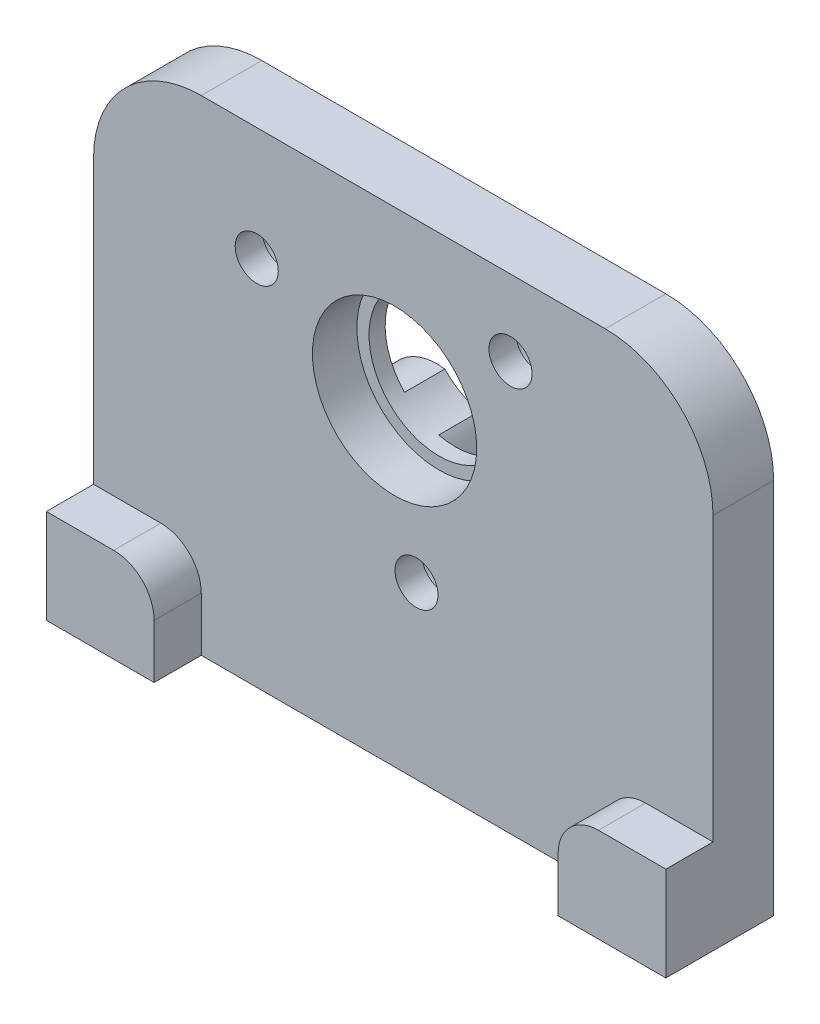
ISO-10303-21;
HEADER;
FILE_DESCRIPTION(('STEP AP214'),'2;1');
FILE_NAME('part.step','',(''),(''),'','','');
FILE_SCHEMA(('AUTOMOTIVE_DESIGN { 1 0 10303 214 1 1 1 1 }'));
ENDSEC;
DATA;
#1=APPLICATION_CONTEXT('core data for automotive mechanical design processes');
#2=APPLICATION_PROTOCOL_DEFINITION('international standard','automotive_design',2000,#1);
#3=PRODUCT_CONTEXT('',#1,'mechanical');
#4=PRODUCT('Part','Part','',(#3));
#5=PRODUCT_RELATED_PRODUCT_CATEGORY('part','',(#4));
#6=PRODUCT_DEFINITION_FORMATION('','',#4);
#7=PRODUCT_DEFINITION_CONTEXT('part definition',#1,'design');
#8=PRODUCT_DEFINITION('design','',#6,#7);
#9=PRODUCT_DEFINITION_SHAPE('','',#8);
#10=(LENGTH_UNIT() NAMED_UNIT(*) SI_UNIT(.MILLI.,.METRE.));
#11=(NAMED_UNIT(*) PLANE_ANGLE_UNIT() SI_UNIT($,.RADIAN.));
#12=(NAMED_UNIT(*) SI_UNIT($,.STERADIAN.) SOLID_ANGLE_UNIT());
#13=UNCERTAINTY_MEASURE_WITH_UNIT(LENGTH_MEASURE(1.E-05),#10,'distance_accuracy_value','');
#14=(GEOMETRIC_REPRESENTATION_CONTEXT(3) GLOBAL_UNCERTAINTY_ASSIGNED_CONTEXT((#13)) GLOBAL_UNIT_ASSIGNED_CONTEXT((#10,
#11,#12)) REPRESENTATION_CONTEXT('',''));
#15=CARTESIAN_POINT('',(0.,0.,0.));
#16=DIRECTION('',(0.,0.,1.));
#17=DIRECTION('',(1.,0.,0.));
#18=AXIS2_PLACEMENT_3D('',#15,#16,#17);
#19=CARTESIAN_POINT('',(0.,0.,4.5));
#20=DIRECTION('',(0.,0.,1.));
#21=DIRECTION('',(1.,0.,0.));
#22=AXIS2_PLACEMENT_3D('',#19,#20,#21);
#23=PLANE('',#22);
#24=CARTESIAN_POINT('',(-0.645780782,5.541728913,4.5));
#25=DIRECTION('',(0.,0.,1.));
#26=DIRECTION('',(1.,0.,0.));
#27=AXIS2_PLACEMENT_3D('',#24,#25,#26);
#28=CIRCLE('',#27,6.10000000000001);
#29=CARTESIAN_POINT('',(5.45421921800001,5.541728913,4.5));
#30=VERTEX_POINT('',#29);
#31=EDGE_CURVE('E490',#30,#30,#28,.T.);
#32=ORIENTED_EDGE('',*,*,#31,.F.);
#33=EDGE_LOOP('',(#32));
#34=FACE_BOUND('',#33,.T.);
#35=CARTESIAN_POINT('',(7.962908944,12.389389916,4.5));
#36=DIRECTION('',(0.,0.,1.));
#37=DIRECTION('',(1.,0.,0.));
#38=AXIS2_PLACEMENT_3D('',#35,#36,#37);
#39=CIRCLE('',#38,1.60000000000001);
#40=CARTESIAN_POINT('',(9.56290894400001,12.389389916,4.5));
#41=VERTEX_POINT('',#40);
#42=EDGE_CURVE('E379',#41,#41,#39,.T.);
#43=ORIENTED_EDGE('',*,*,#42,.F.);
#44=EDGE_LOOP('',(#43));
#45=FACE_BOUND('',#44,.T.);
#46=CARTESIAN_POINT('',(-10.88037403,9.573242407,4.5));
#47=DIRECTION('',(0.,0.,1.));
#48=DIRECTION('',(1.,0.,0.));
#49=AXIS2_PLACEMENT_3D('',#46,#47,#48);
#50=CIRCLE('',#49,1.60000000000001);
#51=CARTESIAN_POINT('',(-9.28037402999999,9.573242407,4.5));
#52=VERTEX_POINT('',#51);
#53=EDGE_CURVE('E374',#52,#52,#50,.T.);
#54=ORIENTED_EDGE('',*,*,#53,.F.);
#55=EDGE_LOOP('',(#54));
#56=FACE_BOUND('',#55,.T.);
#57=CARTESIAN_POINT('',(0.980122741,-5.337445584,4.5));
#58=DIRECTION('',(0.,0.,1.));
#59=DIRECTION('',(1.,0.,0.));
#60=AXIS2_PLACEMENT_3D('',#57,#58,#59);
#61=CIRCLE('',#60,1.60000000000001);
#62=CARTESIAN_POINT('',(2.58012274100001,-5.337445584,4.5));
#63=VERTEX_POINT('',#62);
#64=EDGE_CURVE('E369',#63,#63,#61,.T.);
#65=ORIENTED_EDGE('',*,*,#64,.F.);
#66=EDGE_LOOP('',(#65));
#67=FACE_BOUND('',#66,.T.);
#68=DIRECTION('',(0.,1.,0.));
#69=VECTOR('',#68,1.);
#70=CARTESIAN_POINT('',(23.,-18.,4.5));
#71=LINE('',#70,#69);
#72=CARTESIAN_POINT('',(23.,-11.,4.5));
#73=VERTEX_POINT('',#72);
#74=CARTESIAN_POINT('',(23.,10.,4.5));
#75=VERTEX_POINT('',#74);
#76=EDGE_CURVE('E263',#73,#75,#71,.T.);
#77=ORIENTED_EDGE('',*,*,#76,.T.);
#78=CARTESIAN_POINT('',(15.,10.,4.5));
#79=DIRECTION('',(0.,0.,1.));
#80=DIRECTION('',(1.,0.,0.));
#81=AXIS2_PLACEMENT_3D('',#78,#79,#80);
#82=CIRCLE('',#81,8.);
#83=CARTESIAN_POINT('',(15.,18.,4.5));
#84=VERTEX_POINT('',#83);
#85=EDGE_CURVE('E274',#75,#84,#82,.T.);
#86=ORIENTED_EDGE('',*,*,#85,.T.);
#87=DIRECTION('',(-1.,0.,0.));
#88=VECTOR('',#87,1.);
#89=CARTESIAN_POINT('',(23.,18.,4.5));
#90=LINE('',#89,#88);
#91=CARTESIAN_POINT('',(-15.,18.,4.5));
#92=VERTEX_POINT('',#91);
#93=EDGE_CURVE('E248',#84,#92,#90,.T.);
#94=ORIENTED_EDGE('',*,*,#93,.T.);
#95=CARTESIAN_POINT('',(-15.,10.,4.5));
#96=DIRECTION('',(0.,0.,1.));
#97=DIRECTION('',(1.,0.,0.));
#98=AXIS2_PLACEMENT_3D('',#95,#96,#97);
#99=CIRCLE('',#98,8.);
#100=CARTESIAN_POINT('',(-23.,10.,4.5));
#101=VERTEX_POINT('',#100);
#102=EDGE_CURVE('E244',#92,#101,#99,.T.);
#103=ORIENTED_EDGE('',*,*,#102,.T.);
#104=DIRECTION('',(0.,-1.,0.));
#105=VECTOR('',#104,1.);
#106=CARTESIAN_POINT('',(-23.,18.,4.5));
#107=LINE('',#106,#105);
#108=CARTESIAN_POINT('',(-23.,-11.,4.5));
#109=VERTEX_POINT('',#108);
#110=EDGE_CURVE('E245',#101,#109,#107,.T.);
#111=ORIENTED_EDGE('',*,*,#110,.T.);
#112=DIRECTION('',(-1.,0.,0.));
#113=VECTOR('',#112,1.);
#114=CARTESIAN_POINT('',(-23.,-11.,4.5));
#115=LINE('',#114,#113);
#116=CARTESIAN_POINT('',(-18.,-11.,4.5));
#117=VERTEX_POINT('',#116);
#118=EDGE_CURVE('E203',#117,#109,#115,.T.);
#119=ORIENTED_EDGE('',*,*,#118,.F.);
#120=CARTESIAN_POINT('',(-18.,-14.,4.5));
#121=DIRECTION('',(0.,0.,1.));
#122=DIRECTION('',(1.,0.,0.));
#123=AXIS2_PLACEMENT_3D('',#120,#121,#122);
#124=CIRCLE('',#123,3.);
#125=CARTESIAN_POINT('',(-15.,-14.,4.5));
#126=VERTEX_POINT('',#125);
#127=EDGE_CURVE('E237',#117,#126,#124,.F.);
#128=ORIENTED_EDGE('',*,*,#127,.T.);
#129=DIRECTION('',(0.,1.,0.));
#130=VECTOR('',#129,1.);
#131=CARTESIAN_POINT('',(-15.,-11.,4.5));
#132=LINE('',#131,#130);
#133=CARTESIAN_POINT('',(-15.,-18.,4.5));
#134=VERTEX_POINT('',#133);
#135=EDGE_CURVE('E207',#134,#126,#132,.T.);
#136=ORIENTED_EDGE('',*,*,#135,.F.);
#137=DIRECTION('',(1.,0.,0.));
#138=VECTOR('',#137,1.);
#139=CARTESIAN_POINT('',(-23.,-18.,4.5));
#140=LINE('',#139,#138);
#141=CARTESIAN_POINT('',(15.0000000055,-18.,4.5));
#142=VERTEX_POINT('',#141);
#143=EDGE_CURVE('E259',#134,#142,#140,.T.);
#144=ORIENTED_EDGE('',*,*,#143,.T.);
#145=DIRECTION('',(0.,-1.,0.));
#146=VECTOR('',#145,1.);
#147=CARTESIAN_POINT('',(15.0000000055,-18.,4.5));
#148=LINE('',#147,#146);
#149=CARTESIAN_POINT('',(15.0000000055,-14.,4.5));
#150=VERTEX_POINT('',#149);
#151=EDGE_CURVE('E179',#150,#142,#148,.T.);
#152=ORIENTED_EDGE('',*,*,#151,.F.);
#153=CARTESIAN_POINT('',(18.0000000055,-14.,4.5));
#154=DIRECTION('',(0.,0.,1.));
#155=DIRECTION('',(1.,0.,0.));
#156=AXIS2_PLACEMENT_3D('',#153,#154,#155);
#157=CIRCLE('',#156,3.);
#158=CARTESIAN_POINT('',(18.0000000055,-11.,4.5));
#159=VERTEX_POINT('',#158);
#160=EDGE_CURVE('E239',#150,#159,#157,.F.);
#161=ORIENTED_EDGE('',*,*,#160,.T.);
#162=DIRECTION('',(-1.,0.,0.));
#163=VECTOR('',#162,1.);
#164=CARTESIAN_POINT('',(15.0000000055,-11.,4.5));
#165=LINE('',#164,#163);
#166=EDGE_CURVE('E176',#73,#159,#165,.T.);
#167=ORIENTED_EDGE('',*,*,#166,.F.);
#168=EDGE_LOOP('',(#77,#86,#94,#103,#111,#119,#128,#136,#144,#152,#161,#167));
#169=FACE_BOUND('',#168,.T.);
#170=ADVANCED_FACE('F32',(#34,#45,#56,#67,#169),#23,.T.);
#171=CARTESIAN_POINT('',(-23.,-18.,0.));
#172=DIRECTION('',(0.,-1.,0.));
#173=DIRECTION('',(0.,0.,-1.));
#174=AXIS2_PLACEMENT_3D('',#171,#172,#173);
#175=PLANE('',#174);
#176=CARTESIAN_POINT('',(-19.,-18.,4.));
#177=DIRECTION('',(0.,-1.,0.));
#178=DIRECTION('',(0.,0.,-1.));
#179=AXIS2_PLACEMENT_3D('',#176,#177,#178);
#180=CIRCLE('',#179,1.24999999999999);
#181=CARTESIAN_POINT('',(-19.,-18.,2.75000000000001));
#182=VERTEX_POINT('',#181);
#183=EDGE_CURVE('E372',#182,#182,#180,.T.);
#184=ORIENTED_EDGE('',*,*,#183,.F.);
#185=EDGE_LOOP('',(#184));
#186=FACE_BOUND('',#185,.T.);
#187=CARTESIAN_POINT('',(19.,-18.,4.));
#188=DIRECTION('',(0.,-1.,0.));
#189=DIRECTION('',(0.,0.,-1.));
#190=AXIS2_PLACEMENT_3D('',#187,#188,#189);
#191=CIRCLE('',#190,1.24999999999999);
#192=CARTESIAN_POINT('',(19.,-18.,2.75000000000001));
#193=VERTEX_POINT('',#192);
#194=EDGE_CURVE('E414',#193,#193,#191,.T.);
#195=ORIENTED_EDGE('',*,*,#194,.F.);
#196=EDGE_LOOP('',(#195));
#197=FACE_BOUND('',#196,.T.);
#198=CARTESIAN_POINT('',(0.,-18.,2.25));
#199=DIRECTION('',(0.,-1.,0.));
#200=DIRECTION('',(0.,0.,-1.));
#201=AXIS2_PLACEMENT_3D('',#198,#199,#200);
#202=CIRCLE('',#201,1.02499999999999);
#203=CARTESIAN_POINT('',(0.,-18.,1.22500000000001));
#204=VERTEX_POINT('',#203);
#205=EDGE_CURVE('E420',#204,#204,#202,.T.);
#206=ORIENTED_EDGE('',*,*,#205,.F.);
#207=EDGE_LOOP('',(#206));
#208=FACE_BOUND('',#207,.T.);
#209=ORIENTED_EDGE('',*,*,#143,.F.);
#210=DIRECTION('',(0.,0.,-1.));
#211=VECTOR('',#210,1.);
#212=CARTESIAN_POINT('',(-15.,-18.,8.));
#213=LINE('',#212,#211);
#214=CARTESIAN_POINT('',(-15.,-18.,8.));
#215=VERTEX_POINT('',#214);
#216=EDGE_CURVE('E215',#215,#134,#213,.T.);
#217=ORIENTED_EDGE('',*,*,#216,.F.);
#218=DIRECTION('',(1.,0.,0.));
#219=VECTOR('',#218,1.);
#220=CARTESIAN_POINT('',(-15.,-18.,8.));
#221=LINE('',#220,#219);
#222=CARTESIAN_POINT('',(-23.,-18.,8.));
#223=VERTEX_POINT('',#222);
#224=EDGE_CURVE('E210',#223,#215,#221,.T.);
#225=ORIENTED_EDGE('',*,*,#224,.F.);
#226=DIRECTION('',(0.,0.,1.));
#227=VECTOR('',#226,1.);
#228=CARTESIAN_POINT('',(-23.,-18.,0.));
#229=LINE('',#228,#227);
#230=CARTESIAN_POINT('',(-23.,-18.,0.));
#231=VERTEX_POINT('',#230);
#232=EDGE_CURVE('E254',#231,#223,#229,.T.);
#233=ORIENTED_EDGE('',*,*,#232,.F.);
#234=DIRECTION('',(1.,0.,0.));
#235=VECTOR('',#234,1.);
#236=CARTESIAN_POINT('',(-23.,-18.,0.));
#237=LINE('',#236,#235);
#238=CARTESIAN_POINT('',(23.,-18.,0.));
#239=VERTEX_POINT('',#238);
#240=EDGE_CURVE('E218',#231,#239,#237,.T.);
#241=ORIENTED_EDGE('',*,*,#240,.T.);
#242=DIRECTION('',(0.,0.,1.));
#243=VECTOR('',#242,1.);
#244=CARTESIAN_POINT('',(23.,-18.,0.));
#245=LINE('',#244,#243);
#246=CARTESIAN_POINT('',(23.,-18.,8.));
#247=VERTEX_POINT('',#246);
#248=EDGE_CURVE('E256',#239,#247,#245,.T.);
#249=ORIENTED_EDGE('',*,*,#248,.T.);
#250=DIRECTION('',(1.,0.,0.));
#251=VECTOR('',#250,1.);
#252=CARTESIAN_POINT('',(23.,-18.,8.));
#253=LINE('',#252,#251);
#254=CARTESIAN_POINT('',(15.0000000055,-18.,8.));
#255=VERTEX_POINT('',#254);
#256=EDGE_CURVE('E193',#255,#247,#253,.T.);
#257=ORIENTED_EDGE('',*,*,#256,.F.);
#258=DIRECTION('',(0.,0.,-1.));
#259=VECTOR('',#258,1.);
#260=CARTESIAN_POINT('',(15.0000000055,-18.,8.));
#261=LINE('',#260,#259);
#262=EDGE_CURVE('E195',#255,#142,#261,.T.);
#263=ORIENTED_EDGE('',*,*,#262,.T.);
#264=EDGE_LOOP('',(#209,#217,#225,#233,#241,#249,#257,#263));
#265=FACE_BOUND('',#264,.T.);
#266=ADVANCED_FACE('F302',(#186,#197,#208,#265),#175,.T.);
#267=CARTESIAN_POINT('',(-23.,18.,0.));
#268=DIRECTION('',(-1.,0.,0.));
#269=DIRECTION('',(0.,0.,1.));
#270=AXIS2_PLACEMENT_3D('',#267,#268,#269);
#271=PLANE('',#270);
#272=ORIENTED_EDGE('',*,*,#110,.F.);
#273=DIRECTION('',(0.,0.,1.));
#274=VECTOR('',#273,1.);
#275=CARTESIAN_POINT('',(-23.,10.,0.));
#276=LINE('',#275,#274);
#277=CARTESIAN_POINT('',(-23.,10.,0.));
#278=VERTEX_POINT('',#277);
#279=EDGE_CURVE('E11',#101,#278,#276,.F.);
#280=ORIENTED_EDGE('',*,*,#279,.T.);
#281=DIRECTION('',(0.,-1.,0.));
#282=VECTOR('',#281,1.);
#283=CARTESIAN_POINT('',(-23.,18.,0.));
#284=LINE('',#283,#282);
#285=EDGE_CURVE('E258',#278,#231,#284,.T.);
#286=ORIENTED_EDGE('',*,*,#285,.T.);
#287=ORIENTED_EDGE('',*,*,#232,.T.);
#288=DIRECTION('',(0.,-1.,0.));
#289=VECTOR('',#288,1.);
#290=CARTESIAN_POINT('',(-23.,-18.,8.));
#291=LINE('',#290,#289);
#292=CARTESIAN_POINT('',(-23.,-11.,8.));
#293=VERTEX_POINT('',#292);
#294=EDGE_CURVE('E206',#293,#223,#291,.T.);
#295=ORIENTED_EDGE('',*,*,#294,.F.);
#296=DIRECTION('',(0.,0.,-1.));
#297=VECTOR('',#296,1.);
#298=CARTESIAN_POINT('',(-23.,-11.,8.));
#299=LINE('',#298,#297);
#300=EDGE_CURVE('E264',#293,#109,#299,.T.);
#301=ORIENTED_EDGE('',*,*,#300,.T.);
#302=EDGE_LOOP('',(#272,#280,#286,#287,#295,#301));
#303=FACE_BOUND('',#302,.T.);
#304=ADVANCED_FACE('F317',(#303),#271,.T.);
#305=CARTESIAN_POINT('',(23.,18.,0.));
#306=DIRECTION('',(0.,1.,0.));
#307=DIRECTION('',(0.,0.,1.));
#308=AXIS2_PLACEMENT_3D('',#305,#306,#307);
#309=PLANE('',#308);
#310=ORIENTED_EDGE('',*,*,#93,.F.);
#311=DIRECTION('',(0.,0.,1.));
#312=VECTOR('',#311,1.);
#313=CARTESIAN_POINT('',(15.,18.,0.));
#314=LINE('',#313,#312);
#315=CARTESIAN_POINT('',(15.,18.,0.));
#316=VERTEX_POINT('',#315);
#317=EDGE_CURVE('E279',#84,#316,#314,.F.);
#318=ORIENTED_EDGE('',*,*,#317,.T.);
#319=DIRECTION('',(-1.,0.,0.));
#320=VECTOR('',#319,1.);
#321=CARTESIAN_POINT('',(23.,18.,0.));
#322=LINE('',#321,#320);
#323=CARTESIAN_POINT('',(-15.,18.,0.));
#324=VERTEX_POINT('',#323);
#325=EDGE_CURVE('E295',#316,#324,#322,.T.);
#326=ORIENTED_EDGE('',*,*,#325,.T.);
#327=DIRECTION('',(0.,0.,1.));
#328=VECTOR('',#327,1.);
#329=CARTESIAN_POINT('',(-15.,18.,0.));
#330=LINE('',#329,#328);
#331=EDGE_CURVE('E281',#324,#92,#330,.T.);
#332=ORIENTED_EDGE('',*,*,#331,.T.);
#333=EDGE_LOOP('',(#310,#318,#326,#332));
#334=FACE_BOUND('',#333,.T.);
#335=ADVANCED_FACE('F278',(#334),#309,.T.);
#336=CARTESIAN_POINT('',(23.,-18.,0.));
#337=DIRECTION('',(1.,0.,0.));
#338=DIRECTION('',(0.,0.,-1.));
#339=AXIS2_PLACEMENT_3D('',#336,#337,#338);
#340=PLANE('',#339);
#341=DIRECTION('',(0.,1.,0.));
#342=VECTOR('',#341,1.);
#343=CARTESIAN_POINT('',(23.,-18.,0.));
#344=LINE('',#343,#342);
#345=CARTESIAN_POINT('',(23.,10.,0.));
#346=VERTEX_POINT('',#345);
#347=EDGE_CURVE('E293',#239,#346,#344,.T.);
#348=ORIENTED_EDGE('',*,*,#347,.T.);
#349=DIRECTION('',(0.,0.,1.));
#350=VECTOR('',#349,1.);
#351=CARTESIAN_POINT('',(23.,10.,0.));
#352=LINE('',#351,#350);
#353=EDGE_CURVE('E241',#346,#75,#352,.T.);
#354=ORIENTED_EDGE('',*,*,#353,.T.);
#355=ORIENTED_EDGE('',*,*,#76,.F.);
#356=DIRECTION('',(0.,0.,-1.));
#357=VECTOR('',#356,1.);
#358=CARTESIAN_POINT('',(23.,-11.,8.));
#359=LINE('',#358,#357);
#360=CARTESIAN_POINT('',(23.,-11.,8.));
#361=VERTEX_POINT('',#360);
#362=EDGE_CURVE('E200',#361,#73,#359,.T.);
#363=ORIENTED_EDGE('',*,*,#362,.F.);
#364=DIRECTION('',(0.,1.,0.));
#365=VECTOR('',#364,1.);
#366=CARTESIAN_POINT('',(23.,-11.,8.));
#367=LINE('',#366,#365);
#368=EDGE_CURVE('E185',#247,#361,#367,.T.);
#369=ORIENTED_EDGE('',*,*,#368,.F.);
#370=ORIENTED_EDGE('',*,*,#248,.F.);
#371=EDGE_LOOP('',(#348,#354,#355,#363,#369,#370));
#372=FACE_BOUND('',#371,.T.);
#373=ADVANCED_FACE('F297',(#372),#340,.T.);
#374=CARTESIAN_POINT('',(0.,0.,0.));
#375=DIRECTION('',(0.,0.,1.));
#376=DIRECTION('',(1.,0.,0.));
#377=AXIS2_PLACEMENT_3D('',#374,#375,#376);
#378=PLANE('',#377);
#379=CARTESIAN_POINT('',(7.962908944,12.389389916,0.));
#380=DIRECTION('',(0.,0.,-1.));
#381=DIRECTION('',(-1.,0.,0.));
#382=AXIS2_PLACEMENT_3D('',#379,#380,#381);
#383=CIRCLE('',#382,2.69999999999999);
#384=CARTESIAN_POINT('',(5.262908944,12.389389916,0.));
#385=VERTEX_POINT('',#384);
#386=EDGE_CURVE('E394',#385,#385,#383,.T.);
#387=ORIENTED_EDGE('',*,*,#386,.F.);
#388=EDGE_LOOP('',(#387));
#389=FACE_BOUND('',#388,.T.);
#390=CARTESIAN_POINT('',(-10.88037403,9.573242407,0.));
#391=DIRECTION('',(0.,0.,-1.));
#392=DIRECTION('',(-1.,0.,0.));
#393=AXIS2_PLACEMENT_3D('',#390,#391,#392);
#394=CIRCLE('',#393,2.69999999999999);
#395=CARTESIAN_POINT('',(-13.58037403,9.573242407,0.));
#396=VERTEX_POINT('',#395);
#397=EDGE_CURVE('E381',#396,#396,#394,.T.);
#398=ORIENTED_EDGE('',*,*,#397,.F.);
#399=EDGE_LOOP('',(#398));
#400=FACE_BOUND('',#399,.T.);
#401=CARTESIAN_POINT('',(0.980122741,-5.337445584,0.));
#402=DIRECTION('',(0.,0.,-1.));
#403=DIRECTION('',(-1.,0.,0.));
#404=AXIS2_PLACEMENT_3D('',#401,#402,#403);
#405=CIRCLE('',#404,2.69999999999999);
#406=CARTESIAN_POINT('',(-1.71987725899999,-5.337445584,0.));
#407=VERTEX_POINT('',#406);
#408=EDGE_CURVE('E377',#407,#407,#405,.T.);
#409=ORIENTED_EDGE('',*,*,#408,.F.);
#410=EDGE_LOOP('',(#409));
#411=FACE_BOUND('',#410,.T.);
#412=CARTESIAN_POINT('',(-5.,-2.,0.));
#413=DIRECTION('',(0.,0.,1.));
#414=DIRECTION('',(1.,0.,0.));
#415=AXIS2_PLACEMENT_3D('',#412,#413,#414);
#416=CIRCLE('',#415,4.);
#417=CARTESIAN_POINT('',(-4.41231790885004,1.95659320119489,0.));
#418=VERTEX_POINT('',#417);
#419=CARTESIAN_POINT('',(-1.86733082093688,0.487244220929658,0.));
#420=VERTEX_POINT('',#419);
#421=EDGE_CURVE('E172',#418,#420,#416,.T.);
#422=ORIENTED_EDGE('',*,*,#421,.T.);
#423=CARTESIAN_POINT('',(-0.645780782,5.541728913,0.));
#424=DIRECTION('',(0.,0.,1.));
#425=DIRECTION('',(1.,0.,0.));
#426=AXIS2_PLACEMENT_3D('',#423,#424,#425);
#427=CIRCLE('',#426,5.20000000000001);
#428=EDGE_CURVE('E164',#420,#418,#427,.T.);
#429=ORIENTED_EDGE('',*,*,#428,.T.);
#430=EDGE_LOOP('',(#422,#429));
#431=FACE_BOUND('',#430,.T.);
#432=ORIENTED_EDGE('',*,*,#325,.F.);
#433=CARTESIAN_POINT('',(15.,10.,0.));
#434=DIRECTION('',(0.,0.,1.));
#435=DIRECTION('',(1.,0.,0.));
#436=AXIS2_PLACEMENT_3D('',#433,#434,#435);
#437=CIRCLE('',#436,8.);
#438=EDGE_CURVE('E40',#316,#346,#437,.F.);
#439=ORIENTED_EDGE('',*,*,#438,.T.);
#440=ORIENTED_EDGE('',*,*,#347,.F.);
#441=ORIENTED_EDGE('',*,*,#240,.F.);
#442=ORIENTED_EDGE('',*,*,#285,.F.);
#443=CARTESIAN_POINT('',(-15.,10.,0.));
#444=DIRECTION('',(0.,0.,1.));
#445=DIRECTION('',(1.,0.,0.));
#446=AXIS2_PLACEMENT_3D('',#443,#444,#445);
#447=CIRCLE('',#446,8.);
#448=EDGE_CURVE('E52',#278,#324,#447,.F.);
#449=ORIENTED_EDGE('',*,*,#448,.T.);
#450=EDGE_LOOP('',(#432,#439,#440,#441,#442,#449));
#451=FACE_BOUND('',#450,.T.);
#452=ADVANCED_FACE('F291',(#389,#400,#411,#431,#451),#378,.F.);
#453=CARTESIAN_POINT('',(-23.,-11.,8.));
#454=DIRECTION('',(0.,-1.,0.));
#455=DIRECTION('',(0.,0.,-1.));
#456=AXIS2_PLACEMENT_3D('',#453,#454,#455);
#457=PLANE('',#456);
#458=DIRECTION('',(-1.,0.,0.));
#459=VECTOR('',#458,1.);
#460=CARTESIAN_POINT('',(-23.,-11.,8.));
#461=LINE('',#460,#459);
#462=CARTESIAN_POINT('',(-18.,-11.,8.));
#463=VERTEX_POINT('',#462);
#464=EDGE_CURVE('E204',#463,#293,#461,.T.);
#465=ORIENTED_EDGE('',*,*,#464,.F.);
#466=DIRECTION('',(0.,0.,-1.));
#467=VECTOR('',#466,1.);
#468=CARTESIAN_POINT('',(-18.,-11.,8.));
#469=LINE('',#468,#467);
#470=EDGE_CURVE('E173',#463,#117,#469,.T.);
#471=ORIENTED_EDGE('',*,*,#470,.T.);
#472=ORIENTED_EDGE('',*,*,#118,.T.);
#473=ORIENTED_EDGE('',*,*,#300,.F.);
#474=EDGE_LOOP('',(#465,#471,#472,#473));
#475=FACE_BOUND('',#474,.T.);
#476=ADVANCED_FACE('F461',(#475),#457,.F.);
#477=CARTESIAN_POINT('',(-15.,-11.,8.));
#478=DIRECTION('',(-1.,0.,0.));
#479=DIRECTION('',(0.,0.,1.));
#480=AXIS2_PLACEMENT_3D('',#477,#478,#479);
#481=PLANE('',#480);
#482=ORIENTED_EDGE('',*,*,#135,.T.);
#483=DIRECTION('',(0.,0.,-1.));
#484=VECTOR('',#483,1.);
#485=CARTESIAN_POINT('',(-15.,-14.,8.));
#486=LINE('',#485,#484);
#487=CARTESIAN_POINT('',(-15.,-14.,8.));
#488=VERTEX_POINT('',#487);
#489=EDGE_CURVE('E226',#126,#488,#486,.F.);
#490=ORIENTED_EDGE('',*,*,#489,.T.);
#491=DIRECTION('',(0.,1.,0.));
#492=VECTOR('',#491,1.);
#493=CARTESIAN_POINT('',(-15.,-11.,8.));
#494=LINE('',#493,#492);
#495=EDGE_CURVE('E212',#215,#488,#494,.T.);
#496=ORIENTED_EDGE('',*,*,#495,.F.);
#497=ORIENTED_EDGE('',*,*,#216,.T.);
#498=EDGE_LOOP('',(#482,#490,#496,#497));
#499=FACE_BOUND('',#498,.T.);
#500=ADVANCED_FACE('F358',(#499),#481,.F.);
#501=CARTESIAN_POINT('',(0.,0.,8.));
#502=DIRECTION('',(0.,0.,-1.));
#503=DIRECTION('',(-1.,0.,0.));
#504=AXIS2_PLACEMENT_3D('',#501,#502,#503);
#505=PLANE('',#504);
#506=ORIENTED_EDGE('',*,*,#495,.T.);
#507=CARTESIAN_POINT('',(-18.,-14.,8.));
#508=DIRECTION('',(0.,0.,-1.));
#509=DIRECTION('',(-1.,0.,0.));
#510=AXIS2_PLACEMENT_3D('',#507,#508,#509);
#511=CIRCLE('',#510,3.);
#512=EDGE_CURVE('E228',#488,#463,#511,.F.);
#513=ORIENTED_EDGE('',*,*,#512,.T.);
#514=ORIENTED_EDGE('',*,*,#464,.T.);
#515=ORIENTED_EDGE('',*,*,#294,.T.);
#516=ORIENTED_EDGE('',*,*,#224,.T.);
#517=EDGE_LOOP('',(#506,#513,#514,#515,#516));
#518=FACE_BOUND('',#517,.T.);
#519=ADVANCED_FACE('F456',(#518),#505,.F.);
#520=CARTESIAN_POINT('',(15.0000000055,-11.,8.));
#521=DIRECTION('',(0.,-1.,0.));
#522=DIRECTION('',(0.,0.,-1.));
#523=AXIS2_PLACEMENT_3D('',#520,#521,#522);
#524=PLANE('',#523);
#525=ORIENTED_EDGE('',*,*,#166,.T.);
#526=DIRECTION('',(0.,0.,-1.));
#527=VECTOR('',#526,1.);
#528=CARTESIAN_POINT('',(18.0000000055,-11.,8.));
#529=LINE('',#528,#527);
#530=CARTESIAN_POINT('',(18.0000000055,-11.,8.));
#531=VERTEX_POINT('',#530);
#532=EDGE_CURVE('E233',#159,#531,#529,.F.);
#533=ORIENTED_EDGE('',*,*,#532,.T.);
#534=DIRECTION('',(-1.,0.,0.));
#535=VECTOR('',#534,1.);
#536=CARTESIAN_POINT('',(15.0000000055,-11.,8.));
#537=LINE('',#536,#535);
#538=EDGE_CURVE('E188',#361,#531,#537,.T.);
#539=ORIENTED_EDGE('',*,*,#538,.F.);
#540=ORIENTED_EDGE('',*,*,#362,.T.);
#541=EDGE_LOOP('',(#525,#533,#539,#540));
#542=FACE_BOUND('',#541,.T.);
#543=ADVANCED_FACE('F352',(#542),#524,.F.);
#544=CARTESIAN_POINT('',(15.0000000055,-18.,8.));
#545=DIRECTION('',(1.,0.,0.));
#546=DIRECTION('',(0.,0.,-1.));
#547=AXIS2_PLACEMENT_3D('',#544,#545,#546);
#548=PLANE('',#547);
#549=DIRECTION('',(0.,-1.,0.));
#550=VECTOR('',#549,1.);
#551=CARTESIAN_POINT('',(15.0000000055,-18.,8.));
#552=LINE('',#551,#550);
#553=CARTESIAN_POINT('',(15.0000000055,-14.,8.));
#554=VERTEX_POINT('',#553);
#555=EDGE_CURVE('E191',#554,#255,#552,.T.);
#556=ORIENTED_EDGE('',*,*,#555,.F.);
#557=DIRECTION('',(0.,0.,-1.));
#558=VECTOR('',#557,1.);
#559=CARTESIAN_POINT('',(15.0000000055,-14.,8.));
#560=LINE('',#559,#558);
#561=EDGE_CURVE('E230',#554,#150,#560,.T.);
#562=ORIENTED_EDGE('',*,*,#561,.T.);
#563=ORIENTED_EDGE('',*,*,#151,.T.);
#564=ORIENTED_EDGE('',*,*,#262,.F.);
#565=EDGE_LOOP('',(#556,#562,#563,#564));
#566=FACE_BOUND('',#565,.T.);
#567=ADVANCED_FACE('F348',(#566),#548,.F.);
#568=CARTESIAN_POINT('',(0.,0.,8.));
#569=DIRECTION('',(0.,0.,-1.));
#570=DIRECTION('',(-1.,0.,0.));
#571=AXIS2_PLACEMENT_3D('',#568,#569,#570);
#572=PLANE('',#571);
#573=ORIENTED_EDGE('',*,*,#538,.T.);
#574=CARTESIAN_POINT('',(18.0000000055,-14.,8.));
#575=DIRECTION('',(0.,0.,-1.));
#576=DIRECTION('',(-1.,0.,0.));
#577=AXIS2_PLACEMENT_3D('',#574,#575,#576);
#578=CIRCLE('',#577,3.);
#579=EDGE_CURVE('E235',#531,#554,#578,.F.);
#580=ORIENTED_EDGE('',*,*,#579,.T.);
#581=ORIENTED_EDGE('',*,*,#555,.T.);
#582=ORIENTED_EDGE('',*,*,#256,.T.);
#583=ORIENTED_EDGE('',*,*,#368,.T.);
#584=EDGE_LOOP('',(#573,#580,#581,#582,#583));
#585=FACE_BOUND('',#584,.T.);
#586=ADVANCED_FACE('F345',(#585),#572,.F.);
#587=CARTESIAN_POINT('',(-5.,-2.,-3.));
#588=DIRECTION('',(0.,0.,1.));
#589=DIRECTION('',(1.,0.,0.));
#590=AXIS2_PLACEMENT_3D('',#587,#588,#589);
#591=CYLINDRICAL_SURFACE('',#590,4.);
#592=DIRECTION('',(0.,0.,1.));
#593=VECTOR('',#592,1.);
#594=CARTESIAN_POINT('',(-4.41231790885004,1.95659320119489,-0.9));
#595=LINE('',#594,#593);
#596=CARTESIAN_POINT('',(-4.41231790885004,1.95659320119489,-3.));
#597=VERTEX_POINT('',#596);
#598=EDGE_CURVE('E157',#597,#418,#595,.T.);
#599=ORIENTED_EDGE('',*,*,#598,.F.);
#600=CARTESIAN_POINT('',(-5.,-2.,-3.));
#601=DIRECTION('',(0.,0.,1.));
#602=DIRECTION('',(1.,0.,0.));
#603=AXIS2_PLACEMENT_3D('',#600,#601,#602);
#604=CIRCLE('',#603,4.);
#605=CARTESIAN_POINT('',(-1.86733082093688,0.487244220929658,-3.));
#606=VERTEX_POINT('',#605);
#607=EDGE_CURVE('E170',#597,#606,#604,.T.);
#608=ORIENTED_EDGE('',*,*,#607,.T.);
#609=DIRECTION('',(0.,0.,1.));
#610=VECTOR('',#609,1.);
#611=CARTESIAN_POINT('',(-1.86733082093688,0.487244220929658,-0.9));
#612=LINE('',#611,#610);
#613=EDGE_CURVE('E160',#420,#606,#612,.F.);
#614=ORIENTED_EDGE('',*,*,#613,.F.);
#615=ORIENTED_EDGE('',*,*,#421,.F.);
#616=EDGE_LOOP('',(#599,#608,#614,#615));
#617=FACE_BOUND('',#616,.T.);
#618=ADVANCED_FACE('F169',(#617),#591,.T.);
#619=CARTESIAN_POINT('',(-1.,-2.,-3.));
#620=DIRECTION('',(0.,0.,-1.));
#621=DIRECTION('',(-1.,0.,0.));
#622=AXIS2_PLACEMENT_3D('',#619,#620,#621);
#623=PLANE('',#622);
#624=CARTESIAN_POINT('',(-5.,-2.,-3.));
#625=DIRECTION('',(0.,0.,-1.));
#626=DIRECTION('',(-1.,0.,0.));
#627=AXIS2_PLACEMENT_3D('',#624,#625,#626);
#628=CIRCLE('',#627,2.09999999999999);
#629=CARTESIAN_POINT('',(-7.09999999999999,-2.,-3.));
#630=VERTEX_POINT('',#629);
#631=EDGE_CURVE('E496',#630,#630,#628,.T.);
#632=ORIENTED_EDGE('',*,*,#631,.F.);
#633=EDGE_LOOP('',(#632));
#634=FACE_BOUND('',#633,.T.);
#635=CARTESIAN_POINT('',(-0.645780782,5.541728913,-3.));
#636=DIRECTION('',(0.,0.,1.));
#637=DIRECTION('',(1.,0.,0.));
#638=AXIS2_PLACEMENT_3D('',#635,#636,#637);
#639=CIRCLE('',#638,5.20000000000001);
#640=EDGE_CURVE('E153',#597,#606,#639,.T.);
#641=ORIENTED_EDGE('',*,*,#640,.T.);
#642=ORIENTED_EDGE('',*,*,#607,.F.);
#643=EDGE_LOOP('',(#641,#642));
#644=FACE_BOUND('',#643,.T.);
#645=ADVANCED_FACE('F175',(#634,#644),#623,.T.);
#646=CARTESIAN_POINT('',(0.,-9.99999999999999,2.25));
#647=DIRECTION('',(0.,-1.,0.));
#648=DIRECTION('',(0.,0.,-1.));
#649=AXIS2_PLACEMENT_3D('',#646,#647,#648);
#650=CONICAL_SURFACE('',#649,1.02499999999999,1.02974425832057);
#651=CARTESIAN_POINT('',(0.,-9.384117865,2.25));
#652=VERTEX_POINT('',#651);
#653=VERTEX_LOOP('',#652);
#654=FACE_BOUND('',#653,.T.);
#655=CARTESIAN_POINT('',(0.,-9.99999999999999,2.25));
#656=DIRECTION('',(0.,-1.,0.));
#657=DIRECTION('',(0.,0.,-1.));
#658=AXIS2_PLACEMENT_3D('',#655,#656,#657);
#659=CIRCLE('',#658,1.02499999999999);
#660=CARTESIAN_POINT('',(0.,-9.99999999999999,1.22500000000001));
#661=VERTEX_POINT('',#660);
#662=EDGE_CURVE('E181',#661,#661,#659,.T.);
#663=ORIENTED_EDGE('',*,*,#662,.T.);
#664=EDGE_LOOP('',(#663));
#665=FACE_BOUND('',#664,.T.);
#666=ADVANCED_FACE('F425',(#654,#665),#650,.F.);
#667=CARTESIAN_POINT('',(0.,-18.,2.25));
#668=DIRECTION('',(0.,-1.,0.));
#669=DIRECTION('',(0.,0.,-1.));
#670=AXIS2_PLACEMENT_3D('',#667,#668,#669);
#671=CYLINDRICAL_SURFACE('',#670,1.02499999999999);
#672=ORIENTED_EDGE('',*,*,#662,.F.);
#673=EDGE_LOOP('',(#672));
#674=FACE_BOUND('',#673,.T.);
#675=ORIENTED_EDGE('',*,*,#205,.T.);
#676=EDGE_LOOP('',(#675));
#677=FACE_BOUND('',#676,.T.);
#678=ADVANCED_FACE('F427',(#674,#677),#671,.F.);
#679=CARTESIAN_POINT('',(19.,-12.,4.));
#680=DIRECTION('',(0.,-1.,0.));
#681=DIRECTION('',(0.,0.,-1.));
#682=AXIS2_PLACEMENT_3D('',#679,#680,#681);
#683=CONICAL_SURFACE('',#682,1.24999999999999,1.02974425854996);
#684=CARTESIAN_POINT('',(19.,-11.248924226,4.));
#685=VERTEX_POINT('',#684);
#686=VERTEX_LOOP('',#685);
#687=FACE_BOUND('',#686,.T.);
#688=CARTESIAN_POINT('',(19.,-12.,4.));
#689=DIRECTION('',(0.,-1.,0.));
#690=DIRECTION('',(0.,0.,-1.));
#691=AXIS2_PLACEMENT_3D('',#688,#689,#690);
#692=CIRCLE('',#691,1.24999999999999);
#693=CARTESIAN_POINT('',(19.,-12.,2.75000000000001));
#694=VERTEX_POINT('',#693);
#695=EDGE_CURVE('E417',#694,#694,#692,.T.);
#696=ORIENTED_EDGE('',*,*,#695,.T.);
#697=EDGE_LOOP('',(#696));
#698=FACE_BOUND('',#697,.T.);
#699=ADVANCED_FACE('F430',(#687,#698),#683,.F.);
#700=CARTESIAN_POINT('',(19.,-18.,4.));
#701=DIRECTION('',(0.,-1.,0.));
#702=DIRECTION('',(0.,0.,-1.));
#703=AXIS2_PLACEMENT_3D('',#700,#701,#702);
#704=CYLINDRICAL_SURFACE('',#703,1.24999999999999);
#705=ORIENTED_EDGE('',*,*,#695,.F.);
#706=EDGE_LOOP('',(#705));
#707=FACE_BOUND('',#706,.T.);
#708=ORIENTED_EDGE('',*,*,#194,.T.);
#709=EDGE_LOOP('',(#708));
#710=FACE_BOUND('',#709,.T.);
#711=ADVANCED_FACE('F438',(#707,#710),#704,.F.);
#712=CARTESIAN_POINT('',(-19.,-12.,4.));
#713=DIRECTION('',(0.,-1.,0.));
#714=DIRECTION('',(0.,0.,-1.));
#715=AXIS2_PLACEMENT_3D('',#712,#713,#714);
#716=CONICAL_SURFACE('',#715,1.24999999999999,1.02974425854996);
#717=CARTESIAN_POINT('',(-19.,-11.248924226,4.));
#718=VERTEX_POINT('',#717);
#719=VERTEX_LOOP('',#718);
#720=FACE_BOUND('',#719,.T.);
#721=CARTESIAN_POINT('',(-19.,-12.,4.));
#722=DIRECTION('',(0.,-1.,0.));
#723=DIRECTION('',(0.,0.,-1.));
#724=AXIS2_PLACEMENT_3D('',#721,#722,#723);
#725=CIRCLE('',#724,1.24999999999999);
#726=CARTESIAN_POINT('',(-19.,-12.,2.75000000000001));
#727=VERTEX_POINT('',#726);
#728=EDGE_CURVE('E411',#727,#727,#725,.T.);
#729=ORIENTED_EDGE('',*,*,#728,.T.);
#730=EDGE_LOOP('',(#729));
#731=FACE_BOUND('',#730,.T.);
#732=ADVANCED_FACE('F559',(#720,#731),#716,.F.);
#733=CARTESIAN_POINT('',(-19.,-18.,4.));
#734=DIRECTION('',(0.,-1.,0.));
#735=DIRECTION('',(0.,0.,-1.));
#736=AXIS2_PLACEMENT_3D('',#733,#734,#735);
#737=CYLINDRICAL_SURFACE('',#736,1.24999999999999);
#738=ORIENTED_EDGE('',*,*,#728,.F.);
#739=EDGE_LOOP('',(#738));
#740=FACE_BOUND('',#739,.T.);
#741=ORIENTED_EDGE('',*,*,#183,.T.);
#742=EDGE_LOOP('',(#741));
#743=FACE_BOUND('',#742,.T.);
#744=ADVANCED_FACE('F555',(#740,#743),#737,.F.);
#745=CARTESIAN_POINT('',(0.980122741,-5.337445584,0.));
#746=DIRECTION('',(0.,0.,-1.));
#747=DIRECTION('',(-1.,0.,0.));
#748=AXIS2_PLACEMENT_3D('',#745,#746,#747);
#749=CYLINDRICAL_SURFACE('',#748,1.60000000000001);
#750=ORIENTED_EDGE('',*,*,#64,.T.);
#751=EDGE_LOOP('',(#750));
#752=FACE_BOUND('',#751,.T.);
#753=CARTESIAN_POINT('',(0.980122741,-5.337445584,2.5));
#754=DIRECTION('',(0.,0.,-1.));
#755=DIRECTION('',(-1.,0.,0.));
#756=AXIS2_PLACEMENT_3D('',#753,#754,#755);
#757=CIRCLE('',#756,1.60000000000001);
#758=CARTESIAN_POINT('',(-0.619877259000012,-5.337445584,2.5));
#759=VERTEX_POINT('',#758);
#760=EDGE_CURVE('E373',#759,#759,#757,.T.);
#761=ORIENTED_EDGE('',*,*,#760,.T.);
#762=EDGE_LOOP('',(#761));
#763=FACE_BOUND('',#762,.T.);
#764=ADVANCED_FACE('F551',(#752,#763),#749,.F.);
#765=CARTESIAN_POINT('',(2.58012274100001,-5.337445584,2.5));
#766=DIRECTION('',(0.,0.,1.));
#767=DIRECTION('',(1.,0.,0.));
#768=AXIS2_PLACEMENT_3D('',#765,#766,#767);
#769=PLANE('',#768);
#770=ORIENTED_EDGE('',*,*,#760,.F.);
#771=EDGE_LOOP('',(#770));
#772=FACE_BOUND('',#771,.T.);
#773=CARTESIAN_POINT('',(0.980122741,-5.337445584,2.5));
#774=DIRECTION('',(0.,0.,-1.));
#775=DIRECTION('',(-1.,0.,0.));
#776=AXIS2_PLACEMENT_3D('',#773,#774,#775);
#777=CIRCLE('',#776,2.69999999999999);
#778=CARTESIAN_POINT('',(-1.71987725899999,-5.337445584,2.5));
#779=VERTEX_POINT('',#778);
#780=EDGE_CURVE('E404',#779,#779,#777,.T.);
#781=ORIENTED_EDGE('',*,*,#780,.T.);
#782=EDGE_LOOP('',(#781));
#783=FACE_BOUND('',#782,.T.);
#784=ADVANCED_FACE('F547',(#772,#783),#769,.F.);
#785=CARTESIAN_POINT('',(0.980122741,-5.337445584,0.));
#786=DIRECTION('',(0.,0.,-1.));
#787=DIRECTION('',(-1.,0.,0.));
#788=AXIS2_PLACEMENT_3D('',#785,#786,#787);
#789=CYLINDRICAL_SURFACE('',#788,2.69999999999999);
#790=ORIENTED_EDGE('',*,*,#780,.F.);
#791=EDGE_LOOP('',(#790));
#792=FACE_BOUND('',#791,.T.);
#793=ORIENTED_EDGE('',*,*,#408,.T.);
#794=EDGE_LOOP('',(#793));
#795=FACE_BOUND('',#794,.T.);
#796=ADVANCED_FACE('F543',(#792,#795),#789,.F.);
#797=CARTESIAN_POINT('',(-10.88037403,9.573242407,0.));
#798=DIRECTION('',(0.,0.,-1.));
#799=DIRECTION('',(-1.,0.,0.));
#800=AXIS2_PLACEMENT_3D('',#797,#798,#799);
#801=CYLINDRICAL_SURFACE('',#800,1.60000000000001);
#802=ORIENTED_EDGE('',*,*,#53,.T.);
#803=EDGE_LOOP('',(#802));
#804=FACE_BOUND('',#803,.T.);
#805=CARTESIAN_POINT('',(-10.88037403,9.573242407,2.5));
#806=DIRECTION('',(0.,0.,-1.));
#807=DIRECTION('',(-1.,0.,0.));
#808=AXIS2_PLACEMENT_3D('',#805,#806,#807);
#809=CIRCLE('',#808,1.60000000000001);
#810=CARTESIAN_POINT('',(-12.48037403,9.573242407,2.5));
#811=VERTEX_POINT('',#810);
#812=EDGE_CURVE('E378',#811,#811,#809,.T.);
#813=ORIENTED_EDGE('',*,*,#812,.T.);
#814=EDGE_LOOP('',(#813));
#815=FACE_BOUND('',#814,.T.);
#816=ADVANCED_FACE('F539',(#804,#815),#801,.F.);
#817=CARTESIAN_POINT('',(-9.28037402999999,9.573242407,2.5));
#818=DIRECTION('',(0.,0.,1.));
#819=DIRECTION('',(1.,0.,0.));
#820=AXIS2_PLACEMENT_3D('',#817,#818,#819);
#821=PLANE('',#820);
#822=ORIENTED_EDGE('',*,*,#812,.F.);
#823=EDGE_LOOP('',(#822));
#824=FACE_BOUND('',#823,.T.);
#825=CARTESIAN_POINT('',(-10.88037403,9.573242407,2.5));
#826=DIRECTION('',(0.,0.,-1.));
#827=DIRECTION('',(-1.,0.,0.));
#828=AXIS2_PLACEMENT_3D('',#825,#826,#827);
#829=CIRCLE('',#828,2.69999999999999);
#830=CARTESIAN_POINT('',(-13.58037403,9.573242407,2.5));
#831=VERTEX_POINT('',#830);
#832=EDGE_CURVE('E386',#831,#831,#829,.T.);
#833=ORIENTED_EDGE('',*,*,#832,.T.);
#834=EDGE_LOOP('',(#833));
#835=FACE_BOUND('',#834,.T.);
#836=ADVANCED_FACE('F535',(#824,#835),#821,.F.);
#837=CARTESIAN_POINT('',(-10.88037403,9.573242407,0.));
#838=DIRECTION('',(0.,0.,-1.));
#839=DIRECTION('',(-1.,0.,0.));
#840=AXIS2_PLACEMENT_3D('',#837,#838,#839);
#841=CYLINDRICAL_SURFACE('',#840,2.69999999999999);
#842=ORIENTED_EDGE('',*,*,#832,.F.);
#843=EDGE_LOOP('',(#842));
#844=FACE_BOUND('',#843,.T.);
#845=ORIENTED_EDGE('',*,*,#397,.T.);
#846=EDGE_LOOP('',(#845));
#847=FACE_BOUND('',#846,.T.);
#848=ADVANCED_FACE('F532',(#844,#847),#841,.F.);
#849=CARTESIAN_POINT('',(7.962908944,12.389389916,0.));
#850=DIRECTION('',(0.,0.,-1.));
#851=DIRECTION('',(-1.,0.,0.));
#852=AXIS2_PLACEMENT_3D('',#849,#850,#851);
#853=CYLINDRICAL_SURFACE('',#852,1.60000000000001);
#854=ORIENTED_EDGE('',*,*,#42,.T.);
#855=EDGE_LOOP('',(#854));
#856=FACE_BOUND('',#855,.T.);
#857=CARTESIAN_POINT('',(7.962908944,12.389389916,2.5));
#858=DIRECTION('',(0.,0.,-1.));
#859=DIRECTION('',(-1.,0.,0.));
#860=AXIS2_PLACEMENT_3D('',#857,#858,#859);
#861=CIRCLE('',#860,1.60000000000001);
#862=CARTESIAN_POINT('',(6.36290894399999,12.389389916,2.5));
#863=VERTEX_POINT('',#862);
#864=EDGE_CURVE('E382',#863,#863,#861,.T.);
#865=ORIENTED_EDGE('',*,*,#864,.T.);
#866=EDGE_LOOP('',(#865));
#867=FACE_BOUND('',#866,.T.);
#868=ADVANCED_FACE('F528',(#856,#867),#853,.F.);
#869=CARTESIAN_POINT('',(9.56290894400001,12.389389916,2.5));
#870=DIRECTION('',(0.,0.,1.));
#871=DIRECTION('',(1.,0.,0.));
#872=AXIS2_PLACEMENT_3D('',#869,#870,#871);
#873=PLANE('',#872);
#874=ORIENTED_EDGE('',*,*,#864,.F.);
#875=EDGE_LOOP('',(#874));
#876=FACE_BOUND('',#875,.T.);
#877=CARTESIAN_POINT('',(7.962908944,12.389389916,2.5));
#878=DIRECTION('',(0.,0.,-1.));
#879=DIRECTION('',(-1.,0.,0.));
#880=AXIS2_PLACEMENT_3D('',#877,#878,#879);
#881=CIRCLE('',#880,2.69999999999999);
#882=CARTESIAN_POINT('',(5.262908944,12.389389916,2.5));
#883=VERTEX_POINT('',#882);
#884=EDGE_CURVE('E389',#883,#883,#881,.T.);
#885=ORIENTED_EDGE('',*,*,#884,.T.);
#886=EDGE_LOOP('',(#885));
#887=FACE_BOUND('',#886,.T.);
#888=ADVANCED_FACE('F524',(#876,#887),#873,.F.);
#889=CARTESIAN_POINT('',(7.962908944,12.389389916,0.));
#890=DIRECTION('',(0.,0.,-1.));
#891=DIRECTION('',(-1.,0.,0.));
#892=AXIS2_PLACEMENT_3D('',#889,#890,#891);
#893=CYLINDRICAL_SURFACE('',#892,2.69999999999999);
#894=ORIENTED_EDGE('',*,*,#884,.F.);
#895=EDGE_LOOP('',(#894));
#896=FACE_BOUND('',#895,.T.);
#897=ORIENTED_EDGE('',*,*,#386,.T.);
#898=EDGE_LOOP('',(#897));
#899=FACE_BOUND('',#898,.T.);
#900=ADVANCED_FACE('F521',(#896,#899),#893,.F.);
#901=CARTESIAN_POINT('',(-0.645780782,5.541728913,4.5));
#902=DIRECTION('',(0.,0.,1.));
#903=DIRECTION('',(1.,0.,0.));
#904=AXIS2_PLACEMENT_3D('',#901,#902,#903);
#905=CYLINDRICAL_SURFACE('',#904,5.20000000000001);
#906=ORIENTED_EDGE('',*,*,#598,.T.);
#907=ORIENTED_EDGE('',*,*,#428,.F.);
#908=ORIENTED_EDGE('',*,*,#613,.T.);
#909=ORIENTED_EDGE('',*,*,#640,.F.);
#910=EDGE_LOOP('',(#906,#907,#908,#909));
#911=FACE_BOUND('',#910,.T.);
#912=CARTESIAN_POINT('',(-0.645780782,5.541728913,1.2));
#913=DIRECTION('',(0.,0.,1.));
#914=DIRECTION('',(1.,0.,0.));
#915=AXIS2_PLACEMENT_3D('',#912,#913,#914);
#916=CIRCLE('',#915,5.20000000000001);
#917=CARTESIAN_POINT('',(4.55421921800001,5.541728913,1.2));
#918=VERTEX_POINT('',#917);
#919=EDGE_CURVE('E165',#918,#918,#916,.T.);
#920=ORIENTED_EDGE('',*,*,#919,.T.);
#921=EDGE_LOOP('',(#920));
#922=FACE_BOUND('',#921,.T.);
#923=ADVANCED_FACE('F155',(#911,#922),#905,.F.);
#924=CARTESIAN_POINT('',(4.55421921800001,5.541728913,1.2));
#925=DIRECTION('',(0.,0.,-1.));
#926=DIRECTION('',(-1.,0.,0.));
#927=AXIS2_PLACEMENT_3D('',#924,#925,#926);
#928=PLANE('',#927);
#929=ORIENTED_EDGE('',*,*,#919,.F.);
#930=EDGE_LOOP('',(#929));
#931=FACE_BOUND('',#930,.T.);
#932=CARTESIAN_POINT('',(-0.645780782,5.541728913,1.2));
#933=DIRECTION('',(0.,0.,1.));
#934=DIRECTION('',(1.,0.,0.));
#935=AXIS2_PLACEMENT_3D('',#932,#933,#934);
#936=CIRCLE('',#935,6.10000000000001);
#937=CARTESIAN_POINT('',(5.45421921800001,5.541728913,1.2));
#938=VERTEX_POINT('',#937);
#939=EDGE_CURVE('E487',#938,#938,#936,.T.);
#940=ORIENTED_EDGE('',*,*,#939,.T.);
#941=EDGE_LOOP('',(#940));
#942=FACE_BOUND('',#941,.T.);
#943=ADVANCED_FACE('F514',(#931,#942),#928,.F.);
#944=CARTESIAN_POINT('',(-0.645780782,5.541728913,4.5));
#945=DIRECTION('',(0.,0.,1.));
#946=DIRECTION('',(1.,0.,0.));
#947=AXIS2_PLACEMENT_3D('',#944,#945,#946);
#948=CYLINDRICAL_SURFACE('',#947,6.10000000000001);
#949=ORIENTED_EDGE('',*,*,#939,.F.);
#950=EDGE_LOOP('',(#949));
#951=FACE_BOUND('',#950,.T.);
#952=ORIENTED_EDGE('',*,*,#31,.T.);
#953=EDGE_LOOP('',(#952));
#954=FACE_BOUND('',#953,.T.);
#955=ADVANCED_FACE('F507',(#951,#954),#948,.F.);
#956=CARTESIAN_POINT('',(-5.,-2.,4.));
#957=DIRECTION('',(0.,0.,1.));
#958=DIRECTION('',(1.,0.,0.));
#959=AXIS2_PLACEMENT_3D('',#956,#957,#958);
#960=PLANE('',#959);
#961=CARTESIAN_POINT('',(-5.,-2.,4.00000000000001));
#962=DIRECTION('',(0.,0.,-1.));
#963=DIRECTION('',(-1.,0.,0.));
#964=AXIS2_PLACEMENT_3D('',#961,#962,#963);
#965=CIRCLE('',#964,2.09999999999999);
#966=CARTESIAN_POINT('',(-7.09999999999999,-2.,4.00000000000001));
#967=VERTEX_POINT('',#966);
#968=EDGE_CURVE('E493',#967,#967,#965,.T.);
#969=ORIENTED_EDGE('',*,*,#968,.T.);
#970=EDGE_LOOP('',(#969));
#971=FACE_BOUND('',#970,.T.);
#972=ADVANCED_FACE('F501',(#971),#960,.F.);
#973=CARTESIAN_POINT('',(-5.,-2.,-3.));
#974=DIRECTION('',(0.,0.,-1.));
#975=DIRECTION('',(-1.,0.,0.));
#976=AXIS2_PLACEMENT_3D('',#973,#974,#975);
#977=CYLINDRICAL_SURFACE('',#976,2.09999999999999);
#978=ORIENTED_EDGE('',*,*,#968,.F.);
#979=EDGE_LOOP('',(#978));
#980=FACE_BOUND('',#979,.T.);
#981=ORIENTED_EDGE('',*,*,#631,.T.);
#982=EDGE_LOOP('',(#981));
#983=FACE_BOUND('',#982,.T.);
#984=ADVANCED_FACE('F334',(#980,#983),#977,.F.);
#985=CARTESIAN_POINT('',(-18.,-14.,8.));
#986=DIRECTION('',(0.,0.,-1.));
#987=DIRECTION('',(-1.,0.,0.));
#988=AXIS2_PLACEMENT_3D('',#985,#986,#987);
#989=CYLINDRICAL_SURFACE('',#988,3.);
#990=ORIENTED_EDGE('',*,*,#512,.F.);
#991=ORIENTED_EDGE('',*,*,#489,.F.);
#992=ORIENTED_EDGE('',*,*,#127,.F.);
#993=ORIENTED_EDGE('',*,*,#470,.F.);
#994=EDGE_LOOP('',(#990,#991,#992,#993));
#995=FACE_BOUND('',#994,.T.);
#996=ADVANCED_FACE('F331',(#995),#989,.T.);
#997=CARTESIAN_POINT('',(18.0000000055,-14.,8.));
#998=DIRECTION('',(0.,0.,-1.));
#999=DIRECTION('',(-1.,0.,0.));
#1000=AXIS2_PLACEMENT_3D('',#997,#998,#999);
#1001=CYLINDRICAL_SURFACE('',#1000,3.);
#1002=ORIENTED_EDGE('',*,*,#579,.F.);
#1003=ORIENTED_EDGE('',*,*,#532,.F.);
#1004=ORIENTED_EDGE('',*,*,#160,.F.);
#1005=ORIENTED_EDGE('',*,*,#561,.F.);
#1006=EDGE_LOOP('',(#1002,#1003,#1004,#1005));
#1007=FACE_BOUND('',#1006,.T.);
#1008=ADVANCED_FACE('F310',(#1007),#1001,.T.);
#1009=CARTESIAN_POINT('',(15.,10.,0.));
#1010=DIRECTION('',(0.,0.,1.));
#1011=DIRECTION('',(1.,0.,0.));
#1012=AXIS2_PLACEMENT_3D('',#1009,#1010,#1011);
#1013=CYLINDRICAL_SURFACE('',#1012,8.);
#1014=ORIENTED_EDGE('',*,*,#438,.F.);
#1015=ORIENTED_EDGE('',*,*,#317,.F.);
#1016=ORIENTED_EDGE('',*,*,#85,.F.);
#1017=ORIENTED_EDGE('',*,*,#353,.F.);
#1018=EDGE_LOOP('',(#1014,#1015,#1016,#1017));
#1019=FACE_BOUND('',#1018,.T.);
#1020=ADVANCED_FACE('F284',(#1019),#1013,.T.);
#1021=CARTESIAN_POINT('',(-15.,10.,0.));
#1022=DIRECTION('',(0.,0.,1.));
#1023=DIRECTION('',(1.,0.,0.));
#1024=AXIS2_PLACEMENT_3D('',#1021,#1022,#1023);
#1025=CYLINDRICAL_SURFACE('',#1024,8.);
#1026=ORIENTED_EDGE('',*,*,#448,.F.);
#1027=ORIENTED_EDGE('',*,*,#279,.F.);
#1028=ORIENTED_EDGE('',*,*,#102,.F.);
#1029=ORIENTED_EDGE('',*,*,#331,.F.);
#1030=EDGE_LOOP('',(#1026,#1027,#1028,#1029));
#1031=FACE_BOUND('',#1030,.T.);
#1032=ADVANCED_FACE('F34',(#1031),#1025,.T.);
#1033=CLOSED_SHELL('',(#170,#266,#304,#335,#373,#452,#476,#500,#519,#543,#567,#586,#618,#645,
#666,#678,#699,#711,#732,#744,#764,#784,#796,#816,#836,#848,#868,#888,#900,#923,#943,#955,#972,
#984,#996,#1008,#1020,#1032));
#1034=MANIFOLD_SOLID_BREP('B2',#1033);
#1035=ADVANCED_BREP_SHAPE_REPRESENTATION('',(#18,#1034),#14);
#1036=SHAPE_DEFINITION_REPRESENTATION(#9,#1035);
ENDSEC;
END-ISO-10303-21;
